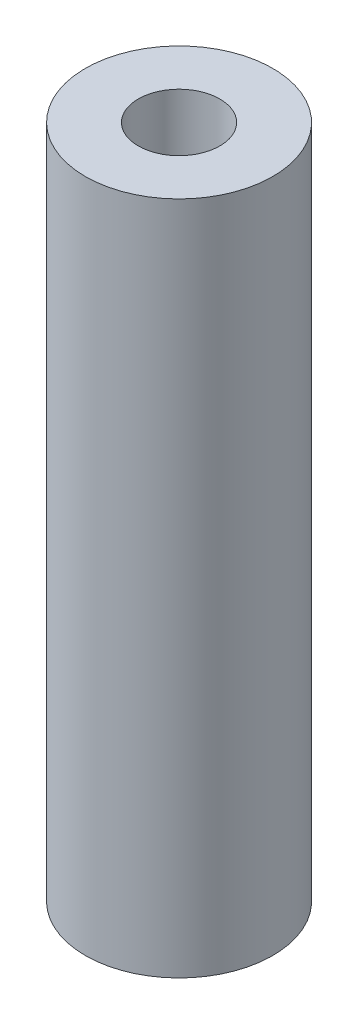
ISO-10303-21;
HEADER;
FILE_DESCRIPTION(('STEP AP214'),'2;1');
FILE_NAME('part.step','',(''),(''),'','','');
FILE_SCHEMA(('AUTOMOTIVE_DESIGN { 1 0 10303 214 1 1 1 1 }'));
ENDSEC;
DATA;
#1=APPLICATION_CONTEXT('core data for automotive mechanical design processes');
#2=APPLICATION_PROTOCOL_DEFINITION('international standard','automotive_design',2000,#1);
#3=PRODUCT_CONTEXT('',#1,'mechanical');
#4=PRODUCT('Part','Part','',(#3));
#5=PRODUCT_RELATED_PRODUCT_CATEGORY('part','',(#4));
#6=PRODUCT_DEFINITION_FORMATION('','',#4);
#7=PRODUCT_DEFINITION_CONTEXT('part definition',#1,'design');
#8=PRODUCT_DEFINITION('design','',#6,#7);
#9=PRODUCT_DEFINITION_SHAPE('','',#8);
#10=(LENGTH_UNIT() NAMED_UNIT(*) SI_UNIT(.MILLI.,.METRE.));
#11=(NAMED_UNIT(*) PLANE_ANGLE_UNIT() SI_UNIT($,.RADIAN.));
#12=(NAMED_UNIT(*) SI_UNIT($,.STERADIAN.) SOLID_ANGLE_UNIT());
#13=UNCERTAINTY_MEASURE_WITH_UNIT(LENGTH_MEASURE(1.E-05),#10,'distance_accuracy_value','');
#14=(GEOMETRIC_REPRESENTATION_CONTEXT(3) GLOBAL_UNCERTAINTY_ASSIGNED_CONTEXT((#13)) GLOBAL_UNIT_ASSIGNED_CONTEXT((#10,
#11,#12)) REPRESENTATION_CONTEXT('',''));
#15=CARTESIAN_POINT('',(0.,0.,0.));
#16=DIRECTION('',(0.,0.,1.));
#17=DIRECTION('',(1.,0.,0.));
#18=AXIS2_PLACEMENT_3D('',#15,#16,#17);
#19=CARTESIAN_POINT('',(0.,36.,0.));
#20=DIRECTION('',(0.,-1.,0.));
#21=DIRECTION('',(0.,0.,-1.));
#22=AXIS2_PLACEMENT_3D('',#19,#20,#21);
#23=CYLINDRICAL_SURFACE('',#22,5.);
#24=CARTESIAN_POINT('',(0.,36.,0.));
#25=DIRECTION('',(0.,1.,0.));
#26=DIRECTION('',(0.,0.,1.));
#27=AXIS2_PLACEMENT_3D('',#24,#25,#26);
#28=CIRCLE('',#27,5.);
#29=CARTESIAN_POINT('',(0.,36.,5.));
#30=VERTEX_POINT('',#29);
#31=EDGE_CURVE('E10',#30,#30,#28,.T.);
#32=ORIENTED_EDGE('',*,*,#31,.F.);
#33=EDGE_LOOP('',(#32));
#34=FACE_BOUND('',#33,.T.);
#35=CARTESIAN_POINT('',(0.,0.,0.));
#36=DIRECTION('',(0.,1.,0.));
#37=DIRECTION('',(0.,0.,1.));
#38=AXIS2_PLACEMENT_3D('',#35,#36,#37);
#39=CIRCLE('',#38,5.);
#40=CARTESIAN_POINT('',(0.,0.,5.));
#41=VERTEX_POINT('',#40);
#42=EDGE_CURVE('E37',#41,#41,#39,.T.);
#43=ORIENTED_EDGE('',*,*,#42,.T.);
#44=EDGE_LOOP('',(#43));
#45=FACE_BOUND('',#44,.T.);
#46=ADVANCED_FACE('F34',(#34,#45),#23,.T.);
#47=CARTESIAN_POINT('',(0.,36.,0.));
#48=DIRECTION('',(0.,1.,0.));
#49=DIRECTION('',(0.,0.,1.));
#50=AXIS2_PLACEMENT_3D('',#47,#48,#49);
#51=PLANE('',#50);
#52=CARTESIAN_POINT('',(0.,36.,0.));
#53=DIRECTION('',(0.,1.,0.));
#54=DIRECTION('',(0.,0.,1.));
#55=AXIS2_PLACEMENT_3D('',#52,#53,#54);
#56=CIRCLE('',#55,2.175);
#57=CARTESIAN_POINT('',(0.,36.,2.175));
#58=VERTEX_POINT('',#57);
#59=EDGE_CURVE('E52',#58,#58,#56,.T.);
#60=ORIENTED_EDGE('',*,*,#59,.F.);
#61=EDGE_LOOP('',(#60));
#62=FACE_BOUND('',#61,.T.);
#63=ORIENTED_EDGE('',*,*,#31,.T.);
#64=EDGE_LOOP('',(#63));
#65=FACE_BOUND('',#64,.T.);
#66=ADVANCED_FACE('F58',(#62,#65),#51,.T.);
#67=CARTESIAN_POINT('',(0.,0.,0.));
#68=DIRECTION('',(0.,1.,0.));
#69=DIRECTION('',(0.,0.,1.));
#70=AXIS2_PLACEMENT_3D('',#67,#68,#69);
#71=PLANE('',#70);
#72=CARTESIAN_POINT('',(0.,0.,0.));
#73=DIRECTION('',(0.,1.,0.));
#74=DIRECTION('',(0.,0.,1.));
#75=AXIS2_PLACEMENT_3D('',#72,#73,#74);
#76=CIRCLE('',#75,2.175);
#77=CARTESIAN_POINT('',(0.,0.,2.175));
#78=VERTEX_POINT('',#77);
#79=EDGE_CURVE('E48',#78,#78,#76,.F.);
#80=ORIENTED_EDGE('',*,*,#79,.F.);
#81=EDGE_LOOP('',(#80));
#82=FACE_BOUND('',#81,.T.);
#83=ORIENTED_EDGE('',*,*,#42,.F.);
#84=EDGE_LOOP('',(#83));
#85=FACE_BOUND('',#84,.T.);
#86=ADVANCED_FACE('F60',(#82,#85),#71,.F.);
#87=CARTESIAN_POINT('',(0.,-6.15182899632297,0.));
#88=DIRECTION('',(0.,1.,0.));
#89=DIRECTION('',(0.,0.,1.));
#90=AXIS2_PLACEMENT_3D('',#87,#88,#89);
#91=CYLINDRICAL_SURFACE('',#90,2.175);
#92=ORIENTED_EDGE('',*,*,#79,.T.);
#93=EDGE_LOOP('',(#92));
#94=FACE_BOUND('',#93,.T.);
#95=ORIENTED_EDGE('',*,*,#59,.T.);
#96=EDGE_LOOP('',(#95));
#97=FACE_BOUND('',#96,.T.);
#98=ADVANCED_FACE('F56',(#94,#97),#91,.F.);
#99=CLOSED_SHELL('',(#46,#66,#86,#98));
#100=MANIFOLD_SOLID_BREP('B2',#99);
#101=ADVANCED_BREP_SHAPE_REPRESENTATION('',(#18,#100),#14);
#102=SHAPE_DEFINITION_REPRESENTATION(#9,#101);
ENDSEC;
END-ISO-10303-21;
